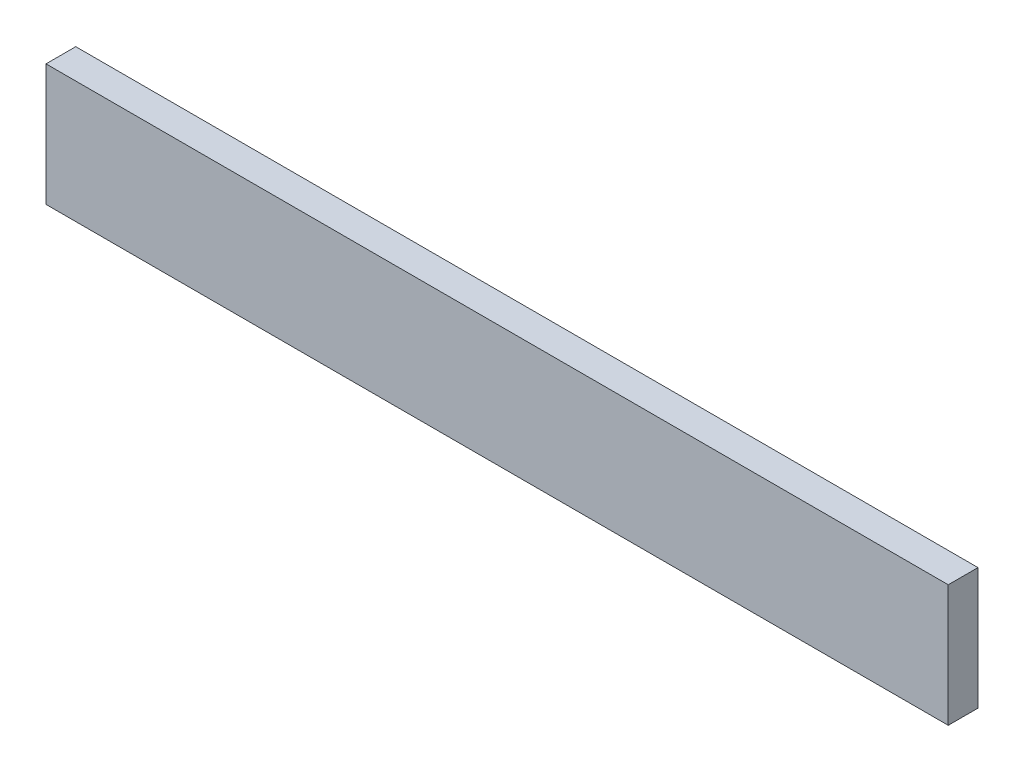
ISO-10303-21;
HEADER;
FILE_DESCRIPTION(('STEP AP214'),'2;1');
FILE_NAME('part.step','',(''),(''),'','','');
FILE_SCHEMA(('AUTOMOTIVE_DESIGN { 1 0 10303 214 1 1 1 1 }'));
ENDSEC;
DATA;
#1=APPLICATION_CONTEXT('core data for automotive mechanical design processes');
#2=APPLICATION_PROTOCOL_DEFINITION('international standard','automotive_design',2000,#1);
#3=PRODUCT_CONTEXT('',#1,'mechanical');
#4=PRODUCT('Part','Part','',(#3));
#5=PRODUCT_RELATED_PRODUCT_CATEGORY('part','',(#4));
#6=PRODUCT_DEFINITION_FORMATION('','',#4);
#7=PRODUCT_DEFINITION_CONTEXT('part definition',#1,'design');
#8=PRODUCT_DEFINITION('design','',#6,#7);
#9=PRODUCT_DEFINITION_SHAPE('','',#8);
#10=(LENGTH_UNIT() NAMED_UNIT(*) SI_UNIT(.MILLI.,.METRE.));
#11=(NAMED_UNIT(*) PLANE_ANGLE_UNIT() SI_UNIT($,.RADIAN.));
#12=(NAMED_UNIT(*) SI_UNIT($,.STERADIAN.) SOLID_ANGLE_UNIT());
#13=UNCERTAINTY_MEASURE_WITH_UNIT(LENGTH_MEASURE(1.E-05),#10,'distance_accuracy_value','');
#14=(GEOMETRIC_REPRESENTATION_CONTEXT(3) GLOBAL_UNCERTAINTY_ASSIGNED_CONTEXT((#13)) GLOBAL_UNIT_ASSIGNED_CONTEXT((#10,
#11,#12)) REPRESENTATION_CONTEXT('',''));
#15=CARTESIAN_POINT('',(0.,0.,0.));
#16=DIRECTION('',(0.,0.,1.));
#17=DIRECTION('',(1.,0.,0.));
#18=AXIS2_PLACEMENT_3D('',#15,#16,#17);
#19=CARTESIAN_POINT('',(0.,0.,22.));
#20=DIRECTION('',(1.,0.,0.));
#21=DIRECTION('',(0.,0.,-1.));
#22=AXIS2_PLACEMENT_3D('',#19,#20,#21);
#23=PLANE('',#22);
#24=DIRECTION('',(0.,-1.,0.));
#25=VECTOR('',#24,1.);
#26=CARTESIAN_POINT('',(0.,0.,0.));
#27=LINE('',#26,#25);
#28=CARTESIAN_POINT('',(0.,90.,0.));
#29=VERTEX_POINT('',#28);
#30=CARTESIAN_POINT('',(0.,0.,0.));
#31=VERTEX_POINT('',#30);
#32=EDGE_CURVE('E94',#29,#31,#27,.T.);
#33=ORIENTED_EDGE('',*,*,#32,.T.);
#34=DIRECTION('',(0.,0.,-1.));
#35=VECTOR('',#34,1.);
#36=CARTESIAN_POINT('',(0.,0.,22.));
#37=LINE('',#36,#35);
#38=CARTESIAN_POINT('',(0.,0.,22.));
#39=VERTEX_POINT('',#38);
#40=EDGE_CURVE('E11',#39,#31,#37,.T.);
#41=ORIENTED_EDGE('',*,*,#40,.F.);
#42=DIRECTION('',(0.,-1.,0.));
#43=VECTOR('',#42,1.);
#44=CARTESIAN_POINT('',(0.,0.,22.));
#45=LINE('',#44,#43);
#46=CARTESIAN_POINT('',(0.,90.,22.));
#47=VERTEX_POINT('',#46);
#48=EDGE_CURVE('E82',#47,#39,#45,.T.);
#49=ORIENTED_EDGE('',*,*,#48,.F.);
#50=DIRECTION('',(0.,0.,-1.));
#51=VECTOR('',#50,1.);
#52=CARTESIAN_POINT('',(0.,90.,22.));
#53=LINE('',#52,#51);
#54=EDGE_CURVE('E90',#47,#29,#53,.T.);
#55=ORIENTED_EDGE('',*,*,#54,.T.);
#56=EDGE_LOOP('',(#33,#41,#49,#55));
#57=FACE_BOUND('',#56,.T.);
#58=ADVANCED_FACE('F31',(#57),#23,.F.);
#59=CARTESIAN_POINT('',(0.,0.,22.));
#60=DIRECTION('',(0.,1.,0.));
#61=DIRECTION('',(0.,0.,1.));
#62=AXIS2_PLACEMENT_3D('',#59,#60,#61);
#63=PLANE('',#62);
#64=DIRECTION('',(1.,0.,0.));
#65=VECTOR('',#64,1.);
#66=CARTESIAN_POINT('',(0.,0.,0.));
#67=LINE('',#66,#65);
#68=CARTESIAN_POINT('',(667.,0.,0.));
#69=VERTEX_POINT('',#68);
#70=EDGE_CURVE('E86',#31,#69,#67,.T.);
#71=ORIENTED_EDGE('',*,*,#70,.T.);
#72=DIRECTION('',(0.,0.,-1.));
#73=VECTOR('',#72,1.);
#74=CARTESIAN_POINT('',(667.,0.,22.));
#75=LINE('',#74,#73);
#76=CARTESIAN_POINT('',(667.,0.,22.));
#77=VERTEX_POINT('',#76);
#78=EDGE_CURVE('E39',#77,#69,#75,.T.);
#79=ORIENTED_EDGE('',*,*,#78,.F.);
#80=DIRECTION('',(1.,0.,0.));
#81=VECTOR('',#80,1.);
#82=CARTESIAN_POINT('',(0.,0.,22.));
#83=LINE('',#82,#81);
#84=EDGE_CURVE('E77',#39,#77,#83,.T.);
#85=ORIENTED_EDGE('',*,*,#84,.F.);
#86=ORIENTED_EDGE('',*,*,#40,.T.);
#87=EDGE_LOOP('',(#71,#79,#85,#86));
#88=FACE_BOUND('',#87,.T.);
#89=ADVANCED_FACE('F85',(#88),#63,.F.);
#90=CARTESIAN_POINT('',(667.,0.,22.));
#91=DIRECTION('',(-1.,0.,0.));
#92=DIRECTION('',(0.,0.,1.));
#93=AXIS2_PLACEMENT_3D('',#90,#91,#92);
#94=PLANE('',#93);
#95=DIRECTION('',(0.,1.,0.));
#96=VECTOR('',#95,1.);
#97=CARTESIAN_POINT('',(667.,0.,0.));
#98=LINE('',#97,#96);
#99=CARTESIAN_POINT('',(667.,90.,0.));
#100=VERTEX_POINT('',#99);
#101=EDGE_CURVE('E64',#69,#100,#98,.T.);
#102=ORIENTED_EDGE('',*,*,#101,.T.);
#103=DIRECTION('',(0.,0.,-1.));
#104=VECTOR('',#103,1.);
#105=CARTESIAN_POINT('',(667.,90.,22.));
#106=LINE('',#105,#104);
#107=CARTESIAN_POINT('',(667.,90.,22.));
#108=VERTEX_POINT('',#107);
#109=EDGE_CURVE('E87',#108,#100,#106,.T.);
#110=ORIENTED_EDGE('',*,*,#109,.F.);
#111=DIRECTION('',(0.,1.,0.));
#112=VECTOR('',#111,1.);
#113=CARTESIAN_POINT('',(667.,0.,22.));
#114=LINE('',#113,#112);
#115=EDGE_CURVE('E80',#77,#108,#114,.T.);
#116=ORIENTED_EDGE('',*,*,#115,.F.);
#117=ORIENTED_EDGE('',*,*,#78,.T.);
#118=EDGE_LOOP('',(#102,#110,#116,#117));
#119=FACE_BOUND('',#118,.T.);
#120=ADVANCED_FACE('F88',(#119),#94,.F.);
#121=CARTESIAN_POINT('',(0.,90.,22.));
#122=DIRECTION('',(0.,-1.,0.));
#123=DIRECTION('',(0.,0.,-1.));
#124=AXIS2_PLACEMENT_3D('',#121,#122,#123);
#125=PLANE('',#124);
#126=DIRECTION('',(-1.,0.,0.));
#127=VECTOR('',#126,1.);
#128=CARTESIAN_POINT('',(0.,90.,0.));
#129=LINE('',#128,#127);
#130=EDGE_CURVE('E70',#100,#29,#129,.T.);
#131=ORIENTED_EDGE('',*,*,#130,.T.);
#132=ORIENTED_EDGE('',*,*,#54,.F.);
#133=DIRECTION('',(-1.,0.,0.));
#134=VECTOR('',#133,1.);
#135=CARTESIAN_POINT('',(0.,90.,22.));
#136=LINE('',#135,#134);
#137=EDGE_CURVE('E47',#108,#47,#136,.T.);
#138=ORIENTED_EDGE('',*,*,#137,.F.);
#139=ORIENTED_EDGE('',*,*,#109,.T.);
#140=EDGE_LOOP('',(#131,#132,#138,#139));
#141=FACE_BOUND('',#140,.T.);
#142=ADVANCED_FACE('F101',(#141),#125,.F.);
#143=CARTESIAN_POINT('',(0.,90.,22.));
#144=DIRECTION('',(0.,0.,-1.));
#145=DIRECTION('',(-1.,0.,0.));
#146=AXIS2_PLACEMENT_3D('',#143,#144,#145);
#147=PLANE('',#146);
#148=ORIENTED_EDGE('',*,*,#48,.T.);
#149=ORIENTED_EDGE('',*,*,#84,.T.);
#150=ORIENTED_EDGE('',*,*,#115,.T.);
#151=ORIENTED_EDGE('',*,*,#137,.T.);
#152=EDGE_LOOP('',(#148,#149,#150,#151));
#153=FACE_BOUND('',#152,.T.);
#154=ADVANCED_FACE('F78',(#153),#147,.F.);
#155=CARTESIAN_POINT('',(0.,90.,0.));
#156=DIRECTION('',(0.,0.,-1.));
#157=DIRECTION('',(-1.,0.,0.));
#158=AXIS2_PLACEMENT_3D('',#155,#156,#157);
#159=PLANE('',#158);
#160=ORIENTED_EDGE('',*,*,#32,.F.);
#161=ORIENTED_EDGE('',*,*,#130,.F.);
#162=ORIENTED_EDGE('',*,*,#101,.F.);
#163=ORIENTED_EDGE('',*,*,#70,.F.);
#164=EDGE_LOOP('',(#160,#161,#162,#163));
#165=FACE_BOUND('',#164,.T.);
#166=ADVANCED_FACE('F104',(#165),#159,.T.);
#167=CLOSED_SHELL('',(#58,#89,#120,#142,#154,#166));
#168=MANIFOLD_SOLID_BREP('B2',#167);
#169=ADVANCED_BREP_SHAPE_REPRESENTATION('',(#18,#168),#14);
#170=SHAPE_DEFINITION_REPRESENTATION(#9,#169);
ENDSEC;
END-ISO-10303-21;
